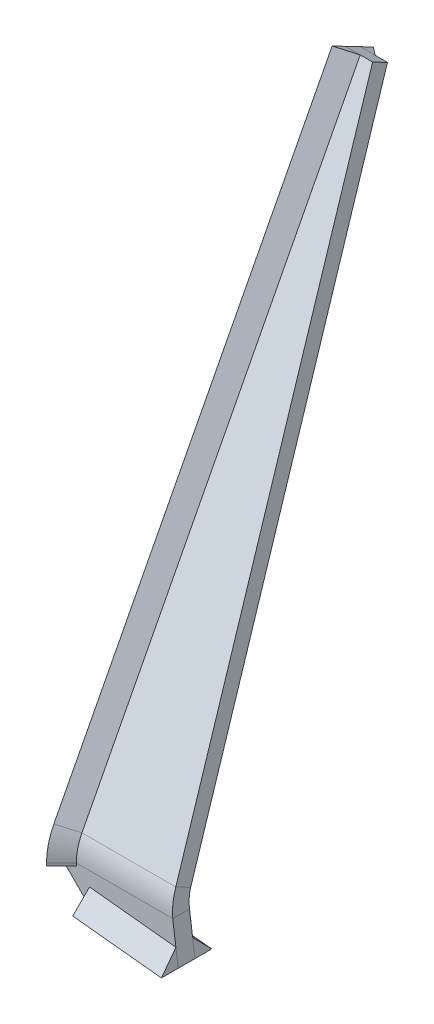
ISO-10303-21;
HEADER;
FILE_DESCRIPTION(('STEP AP214'),'2;1');
FILE_NAME('part.step','',(''),(''),'','','');
FILE_SCHEMA(('AUTOMOTIVE_DESIGN { 1 0 10303 214 1 1 1 1 }'));
ENDSEC;
DATA;
#1=APPLICATION_CONTEXT('core data for automotive mechanical design processes');
#2=APPLICATION_PROTOCOL_DEFINITION('international standard','automotive_design',2000,#1);
#3=PRODUCT_CONTEXT('',#1,'mechanical');
#4=PRODUCT('Part','Part','',(#3));
#5=PRODUCT_RELATED_PRODUCT_CATEGORY('part','',(#4));
#6=PRODUCT_DEFINITION_FORMATION('','',#4);
#7=PRODUCT_DEFINITION_CONTEXT('part definition',#1,'design');
#8=PRODUCT_DEFINITION('design','',#6,#7);
#9=PRODUCT_DEFINITION_SHAPE('','',#8);
#10=(LENGTH_UNIT() NAMED_UNIT(*) SI_UNIT(.MILLI.,.METRE.));
#11=(NAMED_UNIT(*) PLANE_ANGLE_UNIT() SI_UNIT($,.RADIAN.));
#12=(NAMED_UNIT(*) SI_UNIT($,.STERADIAN.) SOLID_ANGLE_UNIT());
#13=UNCERTAINTY_MEASURE_WITH_UNIT(LENGTH_MEASURE(1.E-05),#10,'distance_accuracy_value','');
#14=(GEOMETRIC_REPRESENTATION_CONTEXT(3) GLOBAL_UNCERTAINTY_ASSIGNED_CONTEXT((#13)) GLOBAL_UNIT_ASSIGNED_CONTEXT((#10,
#11,#12)) REPRESENTATION_CONTEXT('',''));
#15=CARTESIAN_POINT('',(0.,0.,0.));
#16=DIRECTION('',(0.,0.,1.));
#17=DIRECTION('',(1.,0.,0.));
#18=AXIS2_PLACEMENT_3D('',#15,#16,#17);
#19=CARTESIAN_POINT('',(3.54804333271288,6.67696676559556,4.00000000000001));
#20=DIRECTION('',(0.,0.,1.));
#21=DIRECTION('',(1.,0.,0.));
#22=AXIS2_PLACEMENT_3D('',#19,#20,#21);
#23=PLANE('',#22);
#24=DIRECTION('',(-1.,0.,0.));
#25=VECTOR('',#24,1.);
#26=CARTESIAN_POINT('',(3.54804333271288,6.67696676559556,4.00000000000001));
#27=LINE('',#26,#25);
#28=CARTESIAN_POINT('',(3.54804333271288,6.67696676559556,4.00000000000001));
#29=VERTEX_POINT('',#28);
#30=CARTESIAN_POINT('',(0.,6.67696676559556,4.00000000000001));
#31=VERTEX_POINT('',#30);
#32=EDGE_CURVE('E123',#29,#31,#27,.T.);
#33=ORIENTED_EDGE('',*,*,#32,.F.);
#34=DIRECTION('',(0.,-1.,0.));
#35=VECTOR('',#34,1.);
#36=CARTESIAN_POINT('',(3.54804333271288,6.67696676559556,4.00000000000001));
#37=LINE('',#36,#35);
#38=CARTESIAN_POINT('',(3.54804333271288,6.00000000000009,4.00000000000001));
#39=VERTEX_POINT('',#38);
#40=EDGE_CURVE('E66',#29,#39,#37,.T.);
#41=ORIENTED_EDGE('',*,*,#40,.T.);
#42=DIRECTION('',(-1.,0.,0.));
#43=VECTOR('',#42,1.);
#44=CARTESIAN_POINT('',(3.54804333271288,6.00000000000009,4.00000000000001));
#45=LINE('',#44,#43);
#46=CARTESIAN_POINT('',(0.,6.00000000000009,4.00000000000001));
#47=VERTEX_POINT('',#46);
#48=EDGE_CURVE('E73',#39,#47,#45,.T.);
#49=ORIENTED_EDGE('',*,*,#48,.T.);
#50=DIRECTION('',(0.,-1.,0.));
#51=VECTOR('',#50,1.);
#52=CARTESIAN_POINT('',(0.,6.67696676559556,4.00000000000001));
#53=LINE('',#52,#51);
#54=EDGE_CURVE('E13',#31,#47,#53,.T.);
#55=ORIENTED_EDGE('',*,*,#54,.F.);
#56=EDGE_LOOP('',(#33,#41,#49,#55));
#57=FACE_BOUND('',#56,.T.);
#58=ADVANCED_FACE('F59',(#57),#23,.F.);
#59=CARTESIAN_POINT('',(0.,6.67696676559555,7.5480433327129));
#60=DIRECTION('',(-0.707106781186548,0.,-0.707106781186547));
#61=DIRECTION('',(-0.707106781186547,0.,0.707106781186548));
#62=AXIS2_PLACEMENT_3D('',#59,#60,#61);
#63=PLANE('',#62);
#64=DIRECTION('',(0.707106781186547,0.,-0.707106781186548));
#65=VECTOR('',#64,1.);
#66=CARTESIAN_POINT('',(0.,6.67696676559555,7.5480433327129));
#67=LINE('',#66,#65);
#68=CARTESIAN_POINT('',(0.,6.67696676559555,7.5480433327129));
#69=VERTEX_POINT('',#68);
#70=EDGE_CURVE('E146',#69,#29,#67,.T.);
#71=ORIENTED_EDGE('',*,*,#70,.F.);
#72=DIRECTION('',(0.,-1.,0.));
#73=VECTOR('',#72,1.);
#74=CARTESIAN_POINT('',(0.,6.67696676559555,7.5480433327129));
#75=LINE('',#74,#73);
#76=CARTESIAN_POINT('',(0.,6.00000000000008,7.5480433327129));
#77=VERTEX_POINT('',#76);
#78=EDGE_CURVE('E118',#69,#77,#75,.T.);
#79=ORIENTED_EDGE('',*,*,#78,.T.);
#80=DIRECTION('',(0.707106781186547,0.,-0.707106781186548));
#81=VECTOR('',#80,1.);
#82=CARTESIAN_POINT('',(0.,6.00000000000008,7.5480433327129));
#83=LINE('',#82,#81);
#84=EDGE_CURVE('E81',#77,#39,#83,.T.);
#85=ORIENTED_EDGE('',*,*,#84,.T.);
#86=ORIENTED_EDGE('',*,*,#40,.F.);
#87=EDGE_LOOP('',(#71,#79,#85,#86));
#88=FACE_BOUND('',#87,.T.);
#89=ADVANCED_FACE('F159',(#88),#63,.F.);
#90=CARTESIAN_POINT('',(0.,6.67696676559554,-8.));
#91=DIRECTION('',(1.,0.,0.));
#92=DIRECTION('',(0.,1.,0.));
#93=AXIS2_PLACEMENT_3D('',#90,#91,#92);
#94=CYLINDRICAL_SURFACE('',#93,12.);
#95=DIRECTION('',(-1.,0.,0.));
#96=VECTOR('',#95,1.);
#97=CARTESIAN_POINT('',(3.54804333271288,12.217950124416,2.64412999813864));
#98=LINE('',#97,#96);
#99=CARTESIAN_POINT('',(3.54804333271288,12.217950124416,2.64412999813864));
#100=VERTEX_POINT('',#99);
#101=CARTESIAN_POINT('',(0.,12.217950124416,2.64412999813864));
#102=VERTEX_POINT('',#101);
#103=EDGE_CURVE('E131',#100,#102,#98,.T.);
#104=ORIENTED_EDGE('',*,*,#103,.F.);
#105=CARTESIAN_POINT('',(3.54804333271288,6.67696676559554,-8.));
#106=DIRECTION('',(1.,0.,0.));
#107=DIRECTION('',(0.,1.,0.));
#108=AXIS2_PLACEMENT_3D('',#105,#106,#107);
#109=CIRCLE('',#108,12.);
#110=EDGE_CURVE('E122',#100,#29,#109,.T.);
#111=ORIENTED_EDGE('',*,*,#110,.T.);
#112=ORIENTED_EDGE('',*,*,#32,.T.);
#113=CARTESIAN_POINT('',(0.,6.67696676559554,-8.));
#114=DIRECTION('',(1.,0.,0.));
#115=DIRECTION('',(0.,1.,0.));
#116=AXIS2_PLACEMENT_3D('',#113,#114,#115);
#117=CIRCLE('',#116,12.);
#118=EDGE_CURVE('E151',#102,#31,#117,.T.);
#119=ORIENTED_EDGE('',*,*,#118,.F.);
#120=EDGE_LOOP('',(#104,#111,#112,#119));
#121=FACE_BOUND('',#120,.T.);
#122=ADVANCED_FACE('F161',(#121),#94,.F.);
#123=CARTESIAN_POINT('',(0.,6.67696676559554,-8.));
#124=DIRECTION('',(-1.,0.,0.));
#125=DIRECTION('',(0.,-1.,0.));
#126=AXIS2_PLACEMENT_3D('',#123,#124,#125);
#127=CONICAL_SURFACE('',#126,15.5480433327129,0.785398163397448);
#128=DIRECTION('',(0.707106781186547,-0.326505575621977,-0.62721137512625));
#129=VECTOR('',#128,1.);
#130=CARTESIAN_POINT('',(0.,13.856254212994,5.79128287084073));
#131=LINE('',#130,#129);
#132=CARTESIAN_POINT('',(0.,13.856254212994,5.79128287084073));
#133=VERTEX_POINT('',#132);
#134=EDGE_CURVE('E126',#133,#100,#131,.T.);
#135=ORIENTED_EDGE('',*,*,#134,.F.);
#136=CARTESIAN_POINT('',(0.,6.67696676559554,-8.));
#137=DIRECTION('',(1.,0.,0.));
#138=DIRECTION('',(0.,1.,0.));
#139=AXIS2_PLACEMENT_3D('',#136,#137,#138);
#140=CIRCLE('',#139,15.5480433327129);
#141=EDGE_CURVE('E111',#133,#69,#140,.T.);
#142=ORIENTED_EDGE('',*,*,#141,.T.);
#143=ORIENTED_EDGE('',*,*,#70,.T.);
#144=ORIENTED_EDGE('',*,*,#110,.F.);
#145=EDGE_LOOP('',(#135,#142,#143,#144));
#146=FACE_BOUND('',#145,.T.);
#147=ADVANCED_FACE('F127',(#146),#127,.T.);
#148=CARTESIAN_POINT('',(0.,12.217950124416,2.64412999813864));
#149=DIRECTION('',(-1.,0.,0.));
#150=DIRECTION('',(0.,0.,1.));
#151=AXIS2_PLACEMENT_3D('',#148,#149,#150);
#152=PLANE('',#151);
#153=DIRECTION('',(0.,0.461748613235034,0.887010833178221));
#154=VECTOR('',#153,1.);
#155=CARTESIAN_POINT('',(0.,139.660976123687,-63.6985101596913));
#156=LINE('',#155,#154);
#157=CARTESIAN_POINT('',(0.,139.660976123687,-63.6985101596913));
#158=VERTEX_POINT('',#157);
#159=CARTESIAN_POINT('',(0.,141.299280212264,-60.5513572869892));
#160=VERTEX_POINT('',#159);
#161=EDGE_CURVE('E170',#158,#160,#156,.T.);
#162=ORIENTED_EDGE('',*,*,#161,.F.);
#163=DIRECTION('',(0.,0.887010833178221,-0.461748613235035));
#164=VECTOR('',#163,1.);
#165=CARTESIAN_POINT('',(0.,12.217950124416,2.64412999813864));
#166=LINE('',#165,#164);
#167=EDGE_CURVE('E140',#102,#158,#166,.T.);
#168=ORIENTED_EDGE('',*,*,#167,.F.);
#169=ORIENTED_EDGE('',*,*,#118,.T.);
#170=ORIENTED_EDGE('',*,*,#54,.T.);
#171=DIRECTION('',(0.,0.,1.));
#172=VECTOR('',#171,1.);
#173=CARTESIAN_POINT('',(0.,6.00000000000009,4.00000000000001));
#174=LINE('',#173,#172);
#175=EDGE_CURVE('E154',#47,#77,#174,.T.);
#176=ORIENTED_EDGE('',*,*,#175,.T.);
#177=ORIENTED_EDGE('',*,*,#78,.F.);
#178=ORIENTED_EDGE('',*,*,#141,.F.);
#179=DIRECTION('',(0.,0.887010833178221,-0.461748613235035));
#180=VECTOR('',#179,1.);
#181=CARTESIAN_POINT('',(0.,13.856254212994,5.79128287084073));
#182=LINE('',#181,#180);
#183=EDGE_CURVE('E116',#133,#160,#182,.T.);
#184=ORIENTED_EDGE('',*,*,#183,.T.);
#185=EDGE_LOOP('',(#162,#168,#169,#170,#176,#177,#178,#184));
#186=FACE_BOUND('',#185,.T.);
#187=ADVANCED_FACE('F114',(#186),#152,.T.);
#188=CARTESIAN_POINT('',(3.54804333271288,12.217950124416,2.64412999813864));
#189=DIRECTION('',(0.,-0.461748613235035,-0.887010833178221));
#190=DIRECTION('',(0.,0.887010833178221,-0.461748613235035));
#191=AXIS2_PLACEMENT_3D('',#188,#189,#190);
#192=PLANE('',#191);
#193=DIRECTION('',(-1.,0.,0.));
#194=VECTOR('',#193,1.);
#195=CARTESIAN_POINT('',(3.54804333271288,139.660976123687,-63.6985101596913));
#196=LINE('',#195,#194);
#197=CARTESIAN_POINT('',(3.54804333271288,139.660976123687,-63.6985101596913));
#198=VERTEX_POINT('',#197);
#199=EDGE_CURVE('E132',#198,#158,#196,.T.);
#200=ORIENTED_EDGE('',*,*,#199,.F.);
#201=DIRECTION('',(0.,0.887010833178221,-0.461748613235035));
#202=VECTOR('',#201,1.);
#203=CARTESIAN_POINT('',(3.54804333271288,12.217950124416,2.64412999813864));
#204=LINE('',#203,#202);
#205=EDGE_CURVE('E138',#100,#198,#204,.T.);
#206=ORIENTED_EDGE('',*,*,#205,.F.);
#207=ORIENTED_EDGE('',*,*,#103,.T.);
#208=ORIENTED_EDGE('',*,*,#167,.T.);
#209=EDGE_LOOP('',(#200,#206,#207,#208));
#210=FACE_BOUND('',#209,.T.);
#211=ADVANCED_FACE('F166',(#210),#192,.T.);
#212=CARTESIAN_POINT('',(0.,13.856254212994,5.79128287084073));
#213=DIRECTION('',(0.707106781186548,0.326505575621977,0.627211375126249));
#214=DIRECTION('',(0.663578618400424,0.,-0.748106554711148));
#215=AXIS2_PLACEMENT_3D('',#212,#213,#214);
#216=PLANE('',#215);
#217=DIRECTION('',(0.707106781186547,-0.326505575621977,-0.62721137512625));
#218=VECTOR('',#217,1.);
#219=CARTESIAN_POINT('',(0.,141.299280212264,-60.5513572869892));
#220=LINE('',#219,#218);
#221=EDGE_CURVE('E136',#160,#198,#220,.T.);
#222=ORIENTED_EDGE('',*,*,#221,.F.);
#223=ORIENTED_EDGE('',*,*,#183,.F.);
#224=ORIENTED_EDGE('',*,*,#134,.T.);
#225=ORIENTED_EDGE('',*,*,#205,.T.);
#226=EDGE_LOOP('',(#222,#223,#224,#225));
#227=FACE_BOUND('',#226,.T.);
#228=ADVANCED_FACE('F134',(#227),#216,.T.);
#229=CARTESIAN_POINT('',(0.,6.00000000000009,4.00000000000001));
#230=DIRECTION('',(0.,-1.,0.));
#231=DIRECTION('',(0.,0.,-1.));
#232=AXIS2_PLACEMENT_3D('',#229,#230,#231);
#233=PLANE('',#232);
#234=ORIENTED_EDGE('',*,*,#175,.F.);
#235=ORIENTED_EDGE('',*,*,#48,.F.);
#236=ORIENTED_EDGE('',*,*,#84,.F.);
#237=EDGE_LOOP('',(#234,#235,#236));
#238=FACE_BOUND('',#237,.T.);
#239=ADVANCED_FACE('F175',(#238),#233,.T.);
#240=CARTESIAN_POINT('',(0.,139.660976123687,-63.6985101596913));
#241=DIRECTION('',(0.,-0.887010833178221,0.461748613235034));
#242=DIRECTION('',(0.,-0.461748613235034,-0.887010833178221));
#243=AXIS2_PLACEMENT_3D('',#240,#241,#242);
#244=PLANE('',#243);
#245=ORIENTED_EDGE('',*,*,#161,.T.);
#246=ORIENTED_EDGE('',*,*,#221,.T.);
#247=ORIENTED_EDGE('',*,*,#199,.T.);
#248=EDGE_LOOP('',(#245,#246,#247));
#249=FACE_BOUND('',#248,.T.);
#250=ADVANCED_FACE('F169',(#249),#244,.F.);
#251=CLOSED_SHELL('',(#58,#89,#122,#147,#187,#211,#228,#239,#250));
#252=MANIFOLD_SOLID_BREP('B2',#251);
#253=CARTESIAN_POINT('',(3.54804333271288,6.67696676559557,0.));
#254=DIRECTION('',(0.,0.,-1.));
#255=DIRECTION('',(-1.,0.,0.));
#256=AXIS2_PLACEMENT_3D('',#253,#254,#255);
#257=PLANE('',#256);
#258=DIRECTION('',(1.,0.,0.));
#259=VECTOR('',#258,1.);
#260=CARTESIAN_POINT('',(3.54804333271288,6.67696676559557,0.));
#261=LINE('',#260,#259);
#262=CARTESIAN_POINT('',(0.,6.67696676559557,0.));
#263=VERTEX_POINT('',#262);
#264=CARTESIAN_POINT('',(3.54804333271288,6.67696676559557,0.));
#265=VERTEX_POINT('',#264);
#266=EDGE_CURVE('E328',#263,#265,#261,.T.);
#267=ORIENTED_EDGE('',*,*,#266,.F.);
#268=DIRECTION('',(0.,-1.,0.));
#269=VECTOR('',#268,1.);
#270=CARTESIAN_POINT('',(0.,6.67696676559557,0.));
#271=LINE('',#270,#269);
#272=CARTESIAN_POINT('',(0.,6.0000000000001,0.));
#273=VERTEX_POINT('',#272);
#274=EDGE_CURVE('E271',#263,#273,#271,.T.);
#275=ORIENTED_EDGE('',*,*,#274,.T.);
#276=DIRECTION('',(1.,0.,0.));
#277=VECTOR('',#276,1.);
#278=CARTESIAN_POINT('',(3.54804333271288,6.0000000000001,0.));
#279=LINE('',#278,#277);
#280=CARTESIAN_POINT('',(3.54804333271288,6.0000000000001,0.));
#281=VERTEX_POINT('',#280);
#282=EDGE_CURVE('E278',#273,#281,#279,.T.);
#283=ORIENTED_EDGE('',*,*,#282,.T.);
#284=DIRECTION('',(0.,-1.,0.));
#285=VECTOR('',#284,1.);
#286=CARTESIAN_POINT('',(3.54804333271288,6.67696676559557,0.));
#287=LINE('',#286,#285);
#288=EDGE_CURVE('E57',#265,#281,#287,.T.);
#289=ORIENTED_EDGE('',*,*,#288,.F.);
#290=EDGE_LOOP('',(#267,#275,#283,#289));
#291=FACE_BOUND('',#290,.T.);
#292=ADVANCED_FACE('F264',(#291),#257,.F.);
#293=CARTESIAN_POINT('',(0.,6.67696676559558,-3.5480433327129));
#294=DIRECTION('',(-0.707106781186548,0.,0.707106781186547));
#295=DIRECTION('',(0.707106781186547,0.,0.707106781186548));
#296=AXIS2_PLACEMENT_3D('',#293,#294,#295);
#297=PLANE('',#296);
#298=DIRECTION('',(-0.707106781186547,0.,-0.707106781186548));
#299=VECTOR('',#298,1.);
#300=CARTESIAN_POINT('',(0.,6.67696676559558,-3.5480433327129));
#301=LINE('',#300,#299);
#302=CARTESIAN_POINT('',(0.,6.67696676559558,-3.5480433327129));
#303=VERTEX_POINT('',#302);
#304=EDGE_CURVE('E326',#265,#303,#301,.T.);
#305=ORIENTED_EDGE('',*,*,#304,.F.);
#306=ORIENTED_EDGE('',*,*,#288,.T.);
#307=DIRECTION('',(-0.707106781186547,0.,-0.707106781186548));
#308=VECTOR('',#307,1.);
#309=CARTESIAN_POINT('',(0.,6.00000000000011,-3.5480433327129));
#310=LINE('',#309,#308);
#311=CARTESIAN_POINT('',(0.,6.00000000000011,-3.5480433327129));
#312=VERTEX_POINT('',#311);
#313=EDGE_CURVE('E362',#281,#312,#310,.T.);
#314=ORIENTED_EDGE('',*,*,#313,.T.);
#315=DIRECTION('',(0.,-1.,0.));
#316=VECTOR('',#315,1.);
#317=CARTESIAN_POINT('',(0.,6.67696676559558,-3.5480433327129));
#318=LINE('',#317,#316);
#319=EDGE_CURVE('E366',#303,#312,#318,.T.);
#320=ORIENTED_EDGE('',*,*,#319,.F.);
#321=EDGE_LOOP('',(#305,#306,#314,#320));
#322=FACE_BOUND('',#321,.T.);
#323=ADVANCED_FACE('F387',(#322),#297,.F.);
#324=CARTESIAN_POINT('',(0.,6.67696676559554,-8.));
#325=DIRECTION('',(1.,0.,0.));
#326=DIRECTION('',(0.,1.,0.));
#327=AXIS2_PLACEMENT_3D('',#324,#325,#326);
#328=CYLINDRICAL_SURFACE('',#327,7.99999999999999);
#329=DIRECTION('',(1.,0.,0.));
#330=VECTOR('',#329,1.);
#331=CARTESIAN_POINT('',(3.54804333271288,10.3709556714759,-0.903913334574263));
#332=LINE('',#331,#330);
#333=CARTESIAN_POINT('',(0.,10.3709556714759,-0.903913334574263));
#334=VERTEX_POINT('',#333);
#335=CARTESIAN_POINT('',(3.54804333271288,10.3709556714759,-0.903913334574263));
#336=VERTEX_POINT('',#335);
#337=EDGE_CURVE('E339',#334,#336,#332,.T.);
#338=ORIENTED_EDGE('',*,*,#337,.F.);
#339=CARTESIAN_POINT('',(0.,6.67696676559554,-8.));
#340=DIRECTION('',(1.,0.,0.));
#341=DIRECTION('',(0.,1.,0.));
#342=AXIS2_PLACEMENT_3D('',#339,#340,#341);
#343=CIRCLE('',#342,7.99999999999999);
#344=EDGE_CURVE('E327',#334,#263,#343,.T.);
#345=ORIENTED_EDGE('',*,*,#344,.T.);
#346=ORIENTED_EDGE('',*,*,#266,.T.);
#347=CARTESIAN_POINT('',(3.54804333271288,6.67696676559554,-8.));
#348=DIRECTION('',(1.,0.,0.));
#349=DIRECTION('',(0.,1.,0.));
#350=AXIS2_PLACEMENT_3D('',#347,#348,#349);
#351=CIRCLE('',#350,7.99999999999999);
#352=EDGE_CURVE('E360',#336,#265,#351,.T.);
#353=ORIENTED_EDGE('',*,*,#352,.F.);
#354=EDGE_LOOP('',(#338,#345,#346,#353));
#355=FACE_BOUND('',#354,.T.);
#356=ADVANCED_FACE('F371',(#355),#328,.T.);
#357=CARTESIAN_POINT('',(3.54804333271288,6.67696676559554,-8.));
#358=DIRECTION('',(1.,0.,0.));
#359=DIRECTION('',(0.,1.,0.));
#360=AXIS2_PLACEMENT_3D('',#357,#358,#359);
#361=CONICAL_SURFACE('',#360,7.99999999999999,0.785398163397449);
#362=DIRECTION('',(-0.707106781186547,-0.326505575621977,-0.62721137512625));
#363=VECTOR('',#362,1.);
#364=CARTESIAN_POINT('',(0.,8.73265158289788,-4.05106620727635));
#365=LINE('',#364,#363);
#366=CARTESIAN_POINT('',(0.,8.73265158289788,-4.05106620727635));
#367=VERTEX_POINT('',#366);
#368=EDGE_CURVE('E323',#336,#367,#365,.T.);
#369=ORIENTED_EDGE('',*,*,#368,.F.);
#370=ORIENTED_EDGE('',*,*,#352,.T.);
#371=ORIENTED_EDGE('',*,*,#304,.T.);
#372=CARTESIAN_POINT('',(0.,6.67696676559554,-8.));
#373=DIRECTION('',(1.,0.,0.));
#374=DIRECTION('',(0.,1.,0.));
#375=AXIS2_PLACEMENT_3D('',#372,#373,#374);
#376=CIRCLE('',#375,4.4519566672871);
#377=EDGE_CURVE('E318',#367,#303,#376,.T.);
#378=ORIENTED_EDGE('',*,*,#377,.F.);
#379=EDGE_LOOP('',(#369,#370,#371,#378));
#380=FACE_BOUND('',#379,.T.);
#381=ADVANCED_FACE('F320',(#380),#361,.F.);
#382=CARTESIAN_POINT('',(0.,8.73265158289788,-4.05106620727635));
#383=DIRECTION('',(0.707106781186548,-0.326505575621977,-0.627211375126249));
#384=DIRECTION('',(-0.663578618400424,0.,-0.748106554711148));
#385=AXIS2_PLACEMENT_3D('',#382,#383,#384);
#386=PLANE('',#385);
#387=DIRECTION('',(-0.707106781186547,-0.326505575621977,-0.62721137512625));
#388=VECTOR('',#387,1.);
#389=CARTESIAN_POINT('',(0.,136.175677582168,-70.3937063651063));
#390=LINE('',#389,#388);
#391=CARTESIAN_POINT('',(3.54804333271288,137.813981670746,-67.2465534924042));
#392=VERTEX_POINT('',#391);
#393=CARTESIAN_POINT('',(0.,136.175677582168,-70.3937063651063));
#394=VERTEX_POINT('',#393);
#395=EDGE_CURVE('E350',#392,#394,#390,.T.);
#396=ORIENTED_EDGE('',*,*,#395,.F.);
#397=DIRECTION('',(0.,0.887010833178221,-0.461748613235035));
#398=VECTOR('',#397,1.);
#399=CARTESIAN_POINT('',(3.54804333271288,10.3709556714759,-0.903913334574263));
#400=LINE('',#399,#398);
#401=EDGE_CURVE('E342',#336,#392,#400,.T.);
#402=ORIENTED_EDGE('',*,*,#401,.F.);
#403=ORIENTED_EDGE('',*,*,#368,.T.);
#404=DIRECTION('',(0.,0.887010833178221,-0.461748613235035));
#405=VECTOR('',#404,1.);
#406=CARTESIAN_POINT('',(0.,8.73265158289788,-4.05106620727635));
#407=LINE('',#406,#405);
#408=EDGE_CURVE('E331',#367,#394,#407,.T.);
#409=ORIENTED_EDGE('',*,*,#408,.T.);
#410=EDGE_LOOP('',(#396,#402,#403,#409));
#411=FACE_BOUND('',#410,.T.);
#412=ADVANCED_FACE('F341',(#411),#386,.T.);
#413=CARTESIAN_POINT('',(3.54804333271288,10.3709556714759,-0.903913334574263));
#414=DIRECTION('',(0.,0.461748613235035,0.887010833178221));
#415=DIRECTION('',(0.,-0.887010833178221,0.461748613235035));
#416=AXIS2_PLACEMENT_3D('',#413,#414,#415);
#417=PLANE('',#416);
#418=DIRECTION('',(1.,0.,0.));
#419=VECTOR('',#418,1.);
#420=CARTESIAN_POINT('',(3.54804333271288,137.813981670746,-67.2465534924042));
#421=LINE('',#420,#419);
#422=CARTESIAN_POINT('',(0.,137.813981670746,-67.2465534924042));
#423=VERTEX_POINT('',#422);
#424=EDGE_CURVE('E344',#423,#392,#421,.T.);
#425=ORIENTED_EDGE('',*,*,#424,.F.);
#426=DIRECTION('',(0.,0.887010833178221,-0.461748613235035));
#427=VECTOR('',#426,1.);
#428=CARTESIAN_POINT('',(0.,10.3709556714759,-0.903913334574263));
#429=LINE('',#428,#427);
#430=EDGE_CURVE('E338',#334,#423,#429,.T.);
#431=ORIENTED_EDGE('',*,*,#430,.F.);
#432=ORIENTED_EDGE('',*,*,#337,.T.);
#433=ORIENTED_EDGE('',*,*,#401,.T.);
#434=EDGE_LOOP('',(#425,#431,#432,#433));
#435=FACE_BOUND('',#434,.T.);
#436=ADVANCED_FACE('F374',(#435),#417,.T.);
#437=CARTESIAN_POINT('',(0.,10.3709556714759,-0.903913334574263));
#438=DIRECTION('',(-1.,0.,0.));
#439=DIRECTION('',(0.,-1.,0.));
#440=AXIS2_PLACEMENT_3D('',#437,#438,#439);
#441=PLANE('',#440);
#442=DIRECTION('',(0.,0.461748613235034,0.887010833178221));
#443=VECTOR('',#442,1.);
#444=CARTESIAN_POINT('',(0.,137.813981670746,-67.2465534924042));
#445=LINE('',#444,#443);
#446=EDGE_CURVE('E334',#394,#423,#445,.T.);
#447=ORIENTED_EDGE('',*,*,#446,.F.);
#448=ORIENTED_EDGE('',*,*,#408,.F.);
#449=ORIENTED_EDGE('',*,*,#377,.T.);
#450=ORIENTED_EDGE('',*,*,#319,.T.);
#451=DIRECTION('',(0.,0.,1.));
#452=VECTOR('',#451,1.);
#453=CARTESIAN_POINT('',(0.,6.0000000000001,0.));
#454=LINE('',#453,#452);
#455=EDGE_CURVE('E286',#312,#273,#454,.T.);
#456=ORIENTED_EDGE('',*,*,#455,.T.);
#457=ORIENTED_EDGE('',*,*,#274,.F.);
#458=ORIENTED_EDGE('',*,*,#344,.F.);
#459=ORIENTED_EDGE('',*,*,#430,.T.);
#460=EDGE_LOOP('',(#447,#448,#449,#450,#456,#457,#458,#459));
#461=FACE_BOUND('',#460,.T.);
#462=ADVANCED_FACE('F332',(#461),#441,.T.);
#463=CARTESIAN_POINT('',(3.54804333271288,6.0000000000001,0.));
#464=DIRECTION('',(0.,-1.,0.));
#465=DIRECTION('',(0.,0.,-1.));
#466=AXIS2_PLACEMENT_3D('',#463,#464,#465);
#467=PLANE('',#466);
#468=ORIENTED_EDGE('',*,*,#313,.F.);
#469=ORIENTED_EDGE('',*,*,#282,.F.);
#470=ORIENTED_EDGE('',*,*,#455,.F.);
#471=EDGE_LOOP('',(#468,#469,#470));
#472=FACE_BOUND('',#471,.T.);
#473=ADVANCED_FACE('F378',(#472),#467,.T.);
#474=CARTESIAN_POINT('',(3.54804333271288,137.813981670746,-67.2465534924042));
#475=DIRECTION('',(0.,-0.887010833178221,0.461748613235034));
#476=DIRECTION('',(0.,-0.461748613235034,-0.887010833178221));
#477=AXIS2_PLACEMENT_3D('',#474,#475,#476);
#478=PLANE('',#477);
#479=ORIENTED_EDGE('',*,*,#395,.T.);
#480=ORIENTED_EDGE('',*,*,#446,.T.);
#481=ORIENTED_EDGE('',*,*,#424,.T.);
#482=EDGE_LOOP('',(#479,#480,#481));
#483=FACE_BOUND('',#482,.T.);
#484=ADVANCED_FACE('F376',(#483),#478,.F.);
#485=CLOSED_SHELL('',(#292,#323,#356,#381,#412,#436,#462,#473,#484));
#486=MANIFOLD_SOLID_BREP('B7',#485);
#487=CARTESIAN_POINT('',(6.70469146960512,-0.704691469605121,4.));
#488=DIRECTION('',(-1.,0.,0.));
#489=DIRECTION('',(0.,0.,1.));
#490=AXIS2_PLACEMENT_3D('',#487,#488,#489);
#491=PLANE('',#490);
#492=DIRECTION('',(0.,1.,0.));
#493=VECTOR('',#492,1.);
#494=CARTESIAN_POINT('',(6.70469146960512,3.29530853039488,4.));
#495=LINE('',#494,#493);
#496=CARTESIAN_POINT('',(6.70469146960512,-0.704691469605121,4.));
#497=VERTEX_POINT('',#496);
#498=CARTESIAN_POINT('',(6.70469146960512,3.29530853039488,4.));
#499=VERTEX_POINT('',#498);
#500=EDGE_CURVE('E511',#497,#499,#495,.T.);
#501=ORIENTED_EDGE('',*,*,#500,.F.);
#502=DIRECTION('',(0.,0.,-1.));
#503=VECTOR('',#502,1.);
#504=CARTESIAN_POINT('',(6.70469146960512,-0.704691469605121,4.));
#505=LINE('',#504,#503);
#506=CARTESIAN_POINT('',(6.70469146960512,-0.704691469605122,8.));
#507=VERTEX_POINT('',#506);
#508=EDGE_CURVE('E513',#507,#497,#505,.T.);
#509=ORIENTED_EDGE('',*,*,#508,.F.);
#510=DIRECTION('',(0.,-0.707106781186548,0.707106781186547));
#511=VECTOR('',#510,1.);
#512=CARTESIAN_POINT('',(6.70469146960512,3.29530853039488,4.));
#513=LINE('',#512,#511);
#514=EDGE_CURVE('E504',#499,#507,#513,.T.);
#515=ORIENTED_EDGE('',*,*,#514,.F.);
#516=EDGE_LOOP('',(#501,#509,#515));
#517=FACE_BOUND('',#516,.T.);
#518=ADVANCED_FACE('F469',(#517),#491,.T.);
#519=CARTESIAN_POINT('',(33.2805950239565,-3.49793148917952,4.));
#520=DIRECTION('',(0.104528463267651,0.994521895368274,0.));
#521=DIRECTION('',(-0.994521895368274,0.104528463267651,0.));
#522=AXIS2_PLACEMENT_3D('',#519,#520,#521);
#523=PLANE('',#522);
#524=DIRECTION('',(-0.994521895368274,0.104528463267651,0.));
#525=VECTOR('',#524,1.);
#526=CARTESIAN_POINT('',(33.2805950239565,-3.49793148917952,4.));
#527=LINE('',#526,#525);
#528=CARTESIAN_POINT('',(27.8466130703117,-2.92679697149421,4.));
#529=VERTEX_POINT('',#528);
#530=EDGE_CURVE('E516',#529,#497,#527,.T.);
#531=ORIENTED_EDGE('',*,*,#530,.F.);
#532=DIRECTION('',(0.,0.,1.));
#533=VECTOR('',#532,1.);
#534=CARTESIAN_POINT('',(27.8466130703117,-2.92679697149421,4.));
#535=LINE('',#534,#533);
#536=CARTESIAN_POINT('',(27.8466130703117,-2.92679697149421,8.));
#537=VERTEX_POINT('',#536);
#538=EDGE_CURVE('E473',#529,#537,#535,.T.);
#539=ORIENTED_EDGE('',*,*,#538,.T.);
#540=DIRECTION('',(-0.994521895368274,0.104528463267651,0.));
#541=VECTOR('',#540,1.);
#542=CARTESIAN_POINT('',(33.2805950239565,-3.49793148917952,8.));
#543=LINE('',#542,#541);
#544=EDGE_CURVE('E508',#537,#507,#543,.T.);
#545=ORIENTED_EDGE('',*,*,#544,.T.);
#546=ORIENTED_EDGE('',*,*,#508,.T.);
#547=EDGE_LOOP('',(#531,#539,#545,#546));
#548=FACE_BOUND('',#547,.T.);
#549=ADVANCED_FACE('F524',(#548),#523,.F.);
#550=CARTESIAN_POINT('',(33.2805950239565,0.502068510820482,4.));
#551=DIRECTION('',(-0.0741155126847491,-0.70516199939428,-0.70516199939428));
#552=DIRECTION('',(0.,0.707106781186548,-0.707106781186547));
#553=AXIS2_PLACEMENT_3D('',#550,#551,#552);
#554=PLANE('',#553);
#555=ORIENTED_EDGE('',*,*,#544,.F.);
#556=DIRECTION('',(-0.0958164778483682,0.708870741875587,-0.698800024245483));
#557=VECTOR('',#556,1.);
#558=CARTESIAN_POINT('',(27.3957814505822,0.408551518817847,4.71203582231319));
#559=LINE('',#558,#557);
#560=CARTESIAN_POINT('',(27.2981501365742,1.13084880572784,4.));
#561=VERTEX_POINT('',#560);
#562=EDGE_CURVE('E479',#537,#561,#559,.T.);
#563=ORIENTED_EDGE('',*,*,#562,.T.);
#564=DIRECTION('',(-0.994521895368274,0.104528463267651,0.));
#565=VECTOR('',#564,1.);
#566=CARTESIAN_POINT('',(33.2805950239565,0.502068510820482,4.));
#567=LINE('',#566,#565);
#568=EDGE_CURVE('E500',#561,#499,#567,.T.);
#569=ORIENTED_EDGE('',*,*,#568,.T.);
#570=ORIENTED_EDGE('',*,*,#514,.T.);
#571=EDGE_LOOP('',(#555,#563,#569,#570));
#572=FACE_BOUND('',#571,.T.);
#573=ADVANCED_FACE('F503',(#572),#554,.F.);
#574=CARTESIAN_POINT('',(33.2805950239565,0.502068510820482,4.));
#575=DIRECTION('',(0.,0.,1.));
#576=DIRECTION('',(0.,-1.,0.));
#577=AXIS2_PLACEMENT_3D('',#574,#575,#576);
#578=PLANE('',#577);
#579=ORIENTED_EDGE('',*,*,#568,.F.);
#580=DIRECTION('',(0.133949657316128,-0.990988137822493,0.));
#581=VECTOR('',#580,1.);
#582=CARTESIAN_POINT('',(27.4889560997429,-0.280774410893808,4.));
#583=LINE('',#582,#581);
#584=EDGE_CURVE('E262',#561,#529,#583,.T.);
#585=ORIENTED_EDGE('',*,*,#584,.T.);
#586=ORIENTED_EDGE('',*,*,#530,.T.);
#587=ORIENTED_EDGE('',*,*,#500,.T.);
#588=EDGE_LOOP('',(#579,#585,#586,#587));
#589=FACE_BOUND('',#588,.T.);
#590=ADVANCED_FACE('F471',(#589),#578,.F.);
#591=CARTESIAN_POINT('',(27.8466130703117,-2.92679697149421,4.));
#592=DIRECTION('',(-0.990988137822493,-0.133949657316128,0.));
#593=DIRECTION('',(0.133949657316128,-0.990988137822493,0.));
#594=AXIS2_PLACEMENT_3D('',#591,#592,#593);
#595=PLANE('',#594);
#596=ORIENTED_EDGE('',*,*,#562,.F.);
#597=ORIENTED_EDGE('',*,*,#538,.F.);
#598=ORIENTED_EDGE('',*,*,#584,.F.);
#599=EDGE_LOOP('',(#596,#597,#598));
#600=FACE_BOUND('',#599,.T.);
#601=ADVANCED_FACE('F525',(#600),#595,.F.);
#602=CLOSED_SHELL('',(#518,#549,#573,#590,#601));
#603=MANIFOLD_SOLID_BREP('B51',#602);
#604=CARTESIAN_POINT('',(6.70469146960512,-0.70469146960512,-4.));
#605=DIRECTION('',(1.,0.,0.));
#606=DIRECTION('',(0.,0.,-1.));
#607=AXIS2_PLACEMENT_3D('',#604,#605,#606);
#608=PLANE('',#607);
#609=DIRECTION('',(0.,0.707106781186547,0.707106781186548));
#610=VECTOR('',#609,1.);
#611=CARTESIAN_POINT('',(6.70469146960512,3.29530853039488,0.));
#612=LINE('',#611,#610);
#613=CARTESIAN_POINT('',(6.70469146960512,-0.70469146960512,-4.));
#614=VERTEX_POINT('',#613);
#615=CARTESIAN_POINT('',(6.70469146960512,3.29530853039488,0.));
#616=VERTEX_POINT('',#615);
#617=EDGE_CURVE('E617',#614,#616,#612,.T.);
#618=ORIENTED_EDGE('',*,*,#617,.F.);
#619=DIRECTION('',(0.,0.,-1.));
#620=VECTOR('',#619,1.);
#621=CARTESIAN_POINT('',(6.70469146960512,-0.70469146960512,0.));
#622=LINE('',#621,#620);
#623=CARTESIAN_POINT('',(6.70469146960512,-0.70469146960512,0.));
#624=VERTEX_POINT('',#623);
#625=EDGE_CURVE('E619',#624,#614,#622,.T.);
#626=ORIENTED_EDGE('',*,*,#625,.F.);
#627=DIRECTION('',(0.,-1.,0.));
#628=VECTOR('',#627,1.);
#629=CARTESIAN_POINT('',(6.70469146960512,3.29530853039488,0.));
#630=LINE('',#629,#628);
#631=EDGE_CURVE('E610',#616,#624,#630,.T.);
#632=ORIENTED_EDGE('',*,*,#631,.F.);
#633=EDGE_LOOP('',(#618,#626,#632));
#634=FACE_BOUND('',#633,.T.);
#635=ADVANCED_FACE('F575',(#634),#608,.F.);
#636=CARTESIAN_POINT('',(33.2805950239565,-3.49793148917952,0.));
#637=DIRECTION('',(0.104528463267651,0.994521895368274,0.));
#638=DIRECTION('',(-0.994521895368274,0.104528463267651,0.));
#639=AXIS2_PLACEMENT_3D('',#636,#637,#638);
#640=PLANE('',#639);
#641=DIRECTION('',(-0.994521895368274,0.104528463267651,0.));
#642=VECTOR('',#641,1.);
#643=CARTESIAN_POINT('',(33.2805950239565,-3.49793148917952,-4.));
#644=LINE('',#643,#642);
#645=CARTESIAN_POINT('',(27.8466130703117,-2.92679697149421,-4.));
#646=VERTEX_POINT('',#645);
#647=EDGE_CURVE('E622',#646,#614,#644,.T.);
#648=ORIENTED_EDGE('',*,*,#647,.F.);
#649=DIRECTION('',(0.,0.,1.));
#650=VECTOR('',#649,1.);
#651=CARTESIAN_POINT('',(27.8466130703117,-2.92679697149421,0.));
#652=LINE('',#651,#650);
#653=CARTESIAN_POINT('',(27.8466130703117,-2.92679697149421,0.));
#654=VERTEX_POINT('',#653);
#655=EDGE_CURVE('E579',#646,#654,#652,.T.);
#656=ORIENTED_EDGE('',*,*,#655,.T.);
#657=DIRECTION('',(-0.994521895368274,0.104528463267651,0.));
#658=VECTOR('',#657,1.);
#659=CARTESIAN_POINT('',(33.2805950239565,-3.49793148917952,0.));
#660=LINE('',#659,#658);
#661=EDGE_CURVE('E614',#654,#624,#660,.T.);
#662=ORIENTED_EDGE('',*,*,#661,.T.);
#663=ORIENTED_EDGE('',*,*,#625,.T.);
#664=EDGE_LOOP('',(#648,#656,#662,#663));
#665=FACE_BOUND('',#664,.T.);
#666=ADVANCED_FACE('F630',(#665),#640,.F.);
#667=CARTESIAN_POINT('',(33.2805950239565,0.502068510820482,0.));
#668=DIRECTION('',(0.,0.,-1.));
#669=DIRECTION('',(0.,1.,0.));
#670=AXIS2_PLACEMENT_3D('',#667,#668,#669);
#671=PLANE('',#670);
#672=ORIENTED_EDGE('',*,*,#661,.F.);
#673=DIRECTION('',(-0.133949657316128,0.990988137822493,0.));
#674=VECTOR('',#673,1.);
#675=CARTESIAN_POINT('',(27.4889560997429,-0.280774410893807,0.));
#676=LINE('',#675,#674);
#677=CARTESIAN_POINT('',(27.2981501365742,1.13084880572784,0.));
#678=VERTEX_POINT('',#677);
#679=EDGE_CURVE('E585',#654,#678,#676,.T.);
#680=ORIENTED_EDGE('',*,*,#679,.T.);
#681=DIRECTION('',(-0.994521895368274,0.104528463267651,0.));
#682=VECTOR('',#681,1.);
#683=CARTESIAN_POINT('',(33.2805950239565,0.502068510820482,0.));
#684=LINE('',#683,#682);
#685=EDGE_CURVE('E606',#678,#616,#684,.T.);
#686=ORIENTED_EDGE('',*,*,#685,.T.);
#687=ORIENTED_EDGE('',*,*,#631,.T.);
#688=EDGE_LOOP('',(#672,#680,#686,#687));
#689=FACE_BOUND('',#688,.T.);
#690=ADVANCED_FACE('F609',(#689),#671,.F.);
#691=CARTESIAN_POINT('',(33.2805950239565,0.502068510820482,0.));
#692=DIRECTION('',(-0.0741155126847492,-0.70516199939428,0.70516199939428));
#693=DIRECTION('',(0.,-0.707106781186548,-0.707106781186548));
#694=AXIS2_PLACEMENT_3D('',#691,#692,#693);
#695=PLANE('',#694);
#696=ORIENTED_EDGE('',*,*,#685,.F.);
#697=DIRECTION('',(0.0958164778483682,-0.708870741875587,-0.698800024245484));
#698=VECTOR('',#697,1.);
#699=CARTESIAN_POINT('',(27.3957814505822,0.408551518817848,-0.712035822313193));
#700=LINE('',#699,#698);
#701=EDGE_CURVE('E467',#678,#646,#700,.T.);
#702=ORIENTED_EDGE('',*,*,#701,.T.);
#703=ORIENTED_EDGE('',*,*,#647,.T.);
#704=ORIENTED_EDGE('',*,*,#617,.T.);
#705=EDGE_LOOP('',(#696,#702,#703,#704));
#706=FACE_BOUND('',#705,.T.);
#707=ADVANCED_FACE('F577',(#706),#695,.F.);
#708=CARTESIAN_POINT('',(27.8466130703117,-2.92679697149421,4.));
#709=DIRECTION('',(-0.990988137822493,-0.133949657316128,0.));
#710=DIRECTION('',(0.133949657316128,-0.990988137822493,0.));
#711=AXIS2_PLACEMENT_3D('',#708,#709,#710);
#712=PLANE('',#711);
#713=ORIENTED_EDGE('',*,*,#679,.F.);
#714=ORIENTED_EDGE('',*,*,#655,.F.);
#715=ORIENTED_EDGE('',*,*,#701,.F.);
#716=EDGE_LOOP('',(#713,#714,#715));
#717=FACE_BOUND('',#716,.T.);
#718=ADVANCED_FACE('F631',(#717),#712,.F.);
#719=CLOSED_SHELL('',(#635,#666,#690,#707,#718));
#720=MANIFOLD_SOLID_BREP('B256',#719);
#721=CARTESIAN_POINT('',(0.,137.813981670746,-67.2465534924042));
#722=DIRECTION('',(0.,-0.461748613235035,-0.887010833178221));
#723=DIRECTION('',(-1.,0.,0.));
#724=AXIS2_PLACEMENT_3D('',#721,#722,#723);
#725=PLANE('',#724);
#726=DIRECTION('',(-0.133949657316128,0.879017213799663,-0.457587398371905));
#727=VECTOR('',#726,1.);
#728=CARTESIAN_POINT('',(27.8466130703117,-2.26879809210654,5.67592600183419));
#729=LINE('',#728,#727);
#730=CARTESIAN_POINT('',(25.9204952894397,10.3709556714758,-0.903913334574222));
#731=VERTEX_POINT('',#730);
#732=CARTESIAN_POINT('',(6.49999999999999,137.813981670746,-67.2465534924042));
#733=VERTEX_POINT('',#732);
#734=EDGE_CURVE('E844',#731,#733,#729,.T.);
#735=ORIENTED_EDGE('',*,*,#734,.F.);
#736=DIRECTION('',(-1.,0.,0.));
#737=VECTOR('',#736,1.);
#738=CARTESIAN_POINT('',(0.,10.3709556714758,-0.90391333457423));
#739=LINE('',#738,#737);
#740=CARTESIAN_POINT('',(0.,10.3709556714758,-0.90391333457423));
#741=VERTEX_POINT('',#740);
#742=EDGE_CURVE('E833',#731,#741,#739,.T.);
#743=ORIENTED_EDGE('',*,*,#742,.T.);
#744=DIRECTION('',(0.,-0.887010833178221,0.461748613235035));
#745=VECTOR('',#744,1.);
#746=CARTESIAN_POINT('',(0.,137.813981670746,-67.2465534924042));
#747=LINE('',#746,#745);
#748=CARTESIAN_POINT('',(0.,137.813981670746,-67.2465534924042));
#749=VERTEX_POINT('',#748);
#750=EDGE_CURVE('E847',#749,#741,#747,.T.);
#751=ORIENTED_EDGE('',*,*,#750,.F.);
#752=DIRECTION('',(-1.,0.,0.));
#753=VECTOR('',#752,1.);
#754=CARTESIAN_POINT('',(6.49999999999999,137.813981670746,-67.2465534924042));
#755=LINE('',#754,#753);
#756=EDGE_CURVE('E846',#733,#749,#755,.T.);
#757=ORIENTED_EDGE('',*,*,#756,.F.);
#758=EDGE_LOOP('',(#735,#743,#751,#757));
#759=FACE_BOUND('',#758,.T.);
#760=ADVANCED_FACE('F672',(#759),#725,.T.);
#761=CARTESIAN_POINT('',(0.,139.660976123687,-63.6985101596913));
#762=DIRECTION('',(1.,0.,0.));
#763=DIRECTION('',(0.,0.887010833178221,-0.461748613235035));
#764=AXIS2_PLACEMENT_3D('',#761,#762,#763);
#765=PLANE('',#764);
#766=DIRECTION('',(0.,-0.461748613235035,-0.887010833178221));
#767=VECTOR('',#766,1.);
#768=CARTESIAN_POINT('',(0.,12.217950124416,2.64412999813865));
#769=LINE('',#768,#767);
#770=CARTESIAN_POINT('',(0.,12.2179501265741,2.64413000228438));
#771=VERTEX_POINT('',#770);
#772=EDGE_CURVE('E841',#771,#741,#769,.T.);
#773=ORIENTED_EDGE('',*,*,#772,.F.);
#774=DIRECTION('',(0.,-0.887010833178221,0.461748613235035));
#775=VECTOR('',#774,1.);
#776=CARTESIAN_POINT('',(0.,139.660976123687,-63.6985101596913));
#777=LINE('',#776,#775);
#778=CARTESIAN_POINT('',(0.,139.660976123687,-63.6985101596913));
#779=VERTEX_POINT('',#778);
#780=EDGE_CURVE('E960',#779,#771,#777,.T.);
#781=ORIENTED_EDGE('',*,*,#780,.F.);
#782=DIRECTION('',(0.,-0.461748613235035,-0.887010833178221));
#783=VECTOR('',#782,1.);
#784=CARTESIAN_POINT('',(0.,139.660976123687,-63.6985101596913));
#785=LINE('',#784,#783);
#786=EDGE_CURVE('E969',#779,#749,#785,.T.);
#787=ORIENTED_EDGE('',*,*,#786,.T.);
#788=ORIENTED_EDGE('',*,*,#750,.T.);
#789=EDGE_LOOP('',(#773,#781,#787,#788));
#790=FACE_BOUND('',#789,.T.);
#791=ADVANCED_FACE('F818',(#790),#765,.F.);
#792=CARTESIAN_POINT('',(27.8466130703117,-0.421803639166398,9.22396933454708));
#793=DIRECTION('',(-0.990988137822493,-0.118814797139916,0.0618510685090306));
#794=DIRECTION('',(0.133949657316128,-0.879017213799663,0.457587398371906));
#795=AXIS2_PLACEMENT_3D('',#792,#793,#794);
#796=PLANE('',#795);
#797=CARTESIAN_POINT('',(25.9204952894397,10.370955673634,-0.903913330428502));
#798=CARTESIAN_POINT('',(25.9204952894397,12.2179501265741,2.64413000228438));
#799=B_SPLINE_CURVE_WITH_KNOTS('',1,(#797,#798),.UNSPECIFIED.,.F.,.F.,(2,2),(0.,1.),.UNSPECIFIED.);
#800=CARTESIAN_POINT('',(25.9204952894396,12.217950124416,2.64412999813865));
#801=VERTEX_POINT('',#800);
#802=EDGE_CURVE('E753',#731,#801,#799,.T.);
#803=ORIENTED_EDGE('',*,*,#802,.F.);
#804=ORIENTED_EDGE('',*,*,#734,.T.);
#805=DIRECTION('',(0.,-0.461748613235035,-0.887010833178221));
#806=VECTOR('',#805,1.);
#807=CARTESIAN_POINT('',(6.49999999999999,139.660976123687,-63.6985101596913));
#808=LINE('',#807,#806);
#809=CARTESIAN_POINT('',(6.49999999999999,139.660976123687,-63.6985101596913));
#810=VERTEX_POINT('',#809);
#811=EDGE_CURVE('E954',#810,#733,#808,.T.);
#812=ORIENTED_EDGE('',*,*,#811,.F.);
#813=DIRECTION('',(-0.133949657316128,0.879017213799663,-0.457587398371905));
#814=VECTOR('',#813,1.);
#815=CARTESIAN_POINT('',(27.8466130703117,-0.421803639166398,9.22396933454708));
#816=LINE('',#815,#814);
#817=EDGE_CURVE('E961',#801,#810,#816,.T.);
#818=ORIENTED_EDGE('',*,*,#817,.F.);
#819=EDGE_LOOP('',(#803,#804,#812,#818));
#820=FACE_BOUND('',#819,.T.);
#821=ADVANCED_FACE('F812',(#820),#796,.F.);
#822=CARTESIAN_POINT('',(6.49999999999999,139.660976123687,-63.6985101596913));
#823=DIRECTION('',(0.,-0.887010833178221,0.461748613235035));
#824=DIRECTION('',(0.,-0.461748613235035,-0.887010833178221));
#825=AXIS2_PLACEMENT_3D('',#822,#823,#824);
#826=PLANE('',#825);
#827=ORIENTED_EDGE('',*,*,#756,.T.);
#828=ORIENTED_EDGE('',*,*,#786,.F.);
#829=DIRECTION('',(-1.,0.,0.));
#830=VECTOR('',#829,1.);
#831=CARTESIAN_POINT('',(6.49999999999999,139.660976123687,-63.6985101596913));
#832=LINE('',#831,#830);
#833=EDGE_CURVE('E965',#810,#779,#832,.T.);
#834=ORIENTED_EDGE('',*,*,#833,.F.);
#835=ORIENTED_EDGE('',*,*,#811,.T.);
#836=EDGE_LOOP('',(#827,#828,#834,#835));
#837=FACE_BOUND('',#836,.T.);
#838=ADVANCED_FACE('F808',(#837),#826,.F.);
#839=CARTESIAN_POINT('',(0.,139.660976123687,-63.6985101596913));
#840=DIRECTION('',(0.,-0.461748613235035,-0.887010833178221));
#841=DIRECTION('',(-1.,0.,0.));
#842=AXIS2_PLACEMENT_3D('',#839,#840,#841);
#843=PLANE('',#842);
#844=DIRECTION('',(-1.,0.,0.));
#845=VECTOR('',#844,1.);
#846=CARTESIAN_POINT('',(0.,12.217950124416,2.64412999813865));
#847=LINE('',#846,#845);
#848=EDGE_CURVE('E952',#801,#771,#847,.T.);
#849=ORIENTED_EDGE('',*,*,#848,.F.);
#850=ORIENTED_EDGE('',*,*,#817,.T.);
#851=ORIENTED_EDGE('',*,*,#833,.T.);
#852=ORIENTED_EDGE('',*,*,#780,.T.);
#853=EDGE_LOOP('',(#849,#850,#851,#852));
#854=FACE_BOUND('',#853,.T.);
#855=ADVANCED_FACE('F811',(#854),#843,.F.);
#856=CARTESIAN_POINT('',(0.,0.,4.));
#857=DIRECTION('',(0.10452846326765,0.994521895368274,0.));
#858=DIRECTION('',(-0.994521895368274,0.10452846326765,0.));
#859=AXIS2_PLACEMENT_3D('',#856,#857,#858);
#860=PLANE('',#859);
#861=DIRECTION('',(0.994521895368274,-0.10452846326765,0.));
#862=VECTOR('',#861,1.);
#863=CARTESIAN_POINT('',(0.,0.,4.));
#864=LINE('',#863,#862);
#865=CARTESIAN_POINT('',(6.70469146960515,-0.704691469605133,4.));
#866=VERTEX_POINT('',#865);
#867=CARTESIAN_POINT('',(27.8466130703117,-2.92679697149421,4.));
#868=VERTEX_POINT('',#867);
#869=EDGE_CURVE('E776',#866,#868,#864,.T.);
#870=ORIENTED_EDGE('',*,*,#869,.F.);
#871=DIRECTION('',(0.,0.,-1.));
#872=VECTOR('',#871,1.);
#873=CARTESIAN_POINT('',(6.70469146960515,-0.704691469605131,4.));
#874=LINE('',#873,#872);
#875=CARTESIAN_POINT('',(6.70469146960512,-0.70469146960512,0.));
#876=VERTEX_POINT('',#875);
#877=EDGE_CURVE('E850',#866,#876,#874,.T.);
#878=ORIENTED_EDGE('',*,*,#877,.T.);
#879=DIRECTION('',(0.994521895368274,-0.10452846326765,0.));
#880=VECTOR('',#879,1.);
#881=CARTESIAN_POINT('',(0.,0.,0.));
#882=LINE('',#881,#880);
#883=CARTESIAN_POINT('',(27.8466130703117,-2.92679697149421,0.));
#884=VERTEX_POINT('',#883);
#885=EDGE_CURVE('E780',#876,#884,#882,.T.);
#886=ORIENTED_EDGE('',*,*,#885,.T.);
#887=DIRECTION('',(0.,0.,-1.));
#888=VECTOR('',#887,1.);
#889=CARTESIAN_POINT('',(27.8466130703117,-2.92679697149421,4.));
#890=LINE('',#889,#888);
#891=EDGE_CURVE('E788',#868,#884,#890,.T.);
#892=ORIENTED_EDGE('',*,*,#891,.F.);
#893=EDGE_LOOP('',(#870,#878,#886,#892));
#894=FACE_BOUND('',#893,.T.);
#895=ADVANCED_FACE('F816',(#894),#860,.F.);
#896=CARTESIAN_POINT('',(0.,155.,4.));
#897=DIRECTION('',(0.,0.,-1.));
#898=DIRECTION('',(-1.,0.,0.));
#899=AXIS2_PLACEMENT_3D('',#896,#897,#898);
#900=PLANE('',#899);
#901=DIRECTION('',(0.,-1.,0.));
#902=VECTOR('',#901,1.);
#903=CARTESIAN_POINT('',(0.,155.,4.));
#904=LINE('',#903,#902);
#905=CARTESIAN_POINT('',(0.,6.67696676559554,4.00000000440979));
#906=VERTEX_POINT('',#905);
#907=CARTESIAN_POINT('',(0.,6.00000000000006,4.));
#908=VERTEX_POINT('',#907);
#909=EDGE_CURVE('E770',#906,#908,#904,.T.);
#910=ORIENTED_EDGE('',*,*,#909,.T.);
#911=DIRECTION('',(-0.707106781186545,0.70710678118655,0.));
#912=VECTOR('',#911,1.);
#913=CARTESIAN_POINT('',(6.70469146960515,-0.704691469605131,4.));
#914=LINE('',#913,#912);
#915=EDGE_CURVE('E573',#908,#866,#914,.F.);
#916=ORIENTED_EDGE('',*,*,#915,.T.);
#917=ORIENTED_EDGE('',*,*,#869,.T.);
#918=DIRECTION('',(-0.133949657316128,0.990988137822493,0.));
#919=VECTOR('',#918,1.);
#920=CARTESIAN_POINT('',(27.8466130703117,-2.92679697149421,4.));
#921=LINE('',#920,#919);
#922=CARTESIAN_POINT('',(26.548493736255,6.67696676559553,4.00000000467383));
#923=VERTEX_POINT('',#922);
#924=EDGE_CURVE('E771',#868,#923,#921,.T.);
#925=ORIENTED_EDGE('',*,*,#924,.T.);
#926=DIRECTION('',(-1.,0.,0.));
#927=VECTOR('',#926,1.);
#928=CARTESIAN_POINT('',(0.,6.67696676559554,4.));
#929=LINE('',#928,#927);
#930=EDGE_CURVE('E765',#923,#906,#929,.T.);
#931=ORIENTED_EDGE('',*,*,#930,.T.);
#932=EDGE_LOOP('',(#910,#916,#917,#925,#931));
#933=FACE_BOUND('',#932,.T.);
#934=ADVANCED_FACE('F774',(#933),#900,.F.);
#935=CARTESIAN_POINT('',(0.,155.,4.));
#936=DIRECTION('',(1.,0.,0.));
#937=DIRECTION('',(0.,1.,0.));
#938=AXIS2_PLACEMENT_3D('',#935,#936,#937);
#939=PLANE('',#938);
#940=DIRECTION('',(0.,-1.,0.));
#941=VECTOR('',#940,1.);
#942=CARTESIAN_POINT('',(0.,155.,0.));
#943=LINE('',#942,#941);
#944=CARTESIAN_POINT('',(0.,6.67696676559554,0.));
#945=VERTEX_POINT('',#944);
#946=CARTESIAN_POINT('',(0.,6.00000000000006,0.));
#947=VERTEX_POINT('',#946);
#948=EDGE_CURVE('E868',#945,#947,#943,.T.);
#949=ORIENTED_EDGE('',*,*,#948,.T.);
#950=DIRECTION('',(0.,0.,1.));
#951=VECTOR('',#950,1.);
#952=CARTESIAN_POINT('',(0.,6.00000000000006,4.));
#953=LINE('',#952,#951);
#954=EDGE_CURVE('E680',#947,#908,#953,.T.);
#955=ORIENTED_EDGE('',*,*,#954,.T.);
#956=ORIENTED_EDGE('',*,*,#909,.F.);
#957=DIRECTION('',(0.,0.,-1.));
#958=VECTOR('',#957,1.);
#959=CARTESIAN_POINT('',(0.,6.67696676559554,4.));
#960=LINE('',#959,#958);
#961=EDGE_CURVE('E865',#906,#945,#960,.T.);
#962=ORIENTED_EDGE('',*,*,#961,.T.);
#963=EDGE_LOOP('',(#949,#955,#956,#962));
#964=FACE_BOUND('',#963,.T.);
#965=ADVANCED_FACE('F949',(#964),#939,.F.);
#966=CARTESIAN_POINT('',(0.,155.,0.));
#967=DIRECTION('',(0.,0.,-1.));
#968=DIRECTION('',(-1.,0.,0.));
#969=AXIS2_PLACEMENT_3D('',#966,#967,#968);
#970=PLANE('',#969);
#971=ORIENTED_EDGE('',*,*,#885,.F.);
#972=DIRECTION('',(0.707106781186545,-0.70710678118655,0.));
#973=VECTOR('',#972,1.);
#974=CARTESIAN_POINT('',(-74.5,80.5000000000005,0.));
#975=LINE('',#974,#973);
#976=EDGE_CURVE('E694',#876,#947,#975,.F.);
#977=ORIENTED_EDGE('',*,*,#976,.T.);
#978=ORIENTED_EDGE('',*,*,#948,.F.);
#979=DIRECTION('',(-1.,0.,0.));
#980=VECTOR('',#979,1.);
#981=CARTESIAN_POINT('',(0.,6.67696676559554,0.));
#982=LINE('',#981,#980);
#983=CARTESIAN_POINT('',(26.548493736255,6.67696676559553,4.67382903213132E-09));
#984=VERTEX_POINT('',#983);
#985=EDGE_CURVE('E857',#984,#945,#982,.T.);
#986=ORIENTED_EDGE('',*,*,#985,.F.);
#987=DIRECTION('',(-0.133949657316128,0.990988137822493,0.));
#988=VECTOR('',#987,1.);
#989=CARTESIAN_POINT('',(27.8466130703117,-2.92679697149421,0.));
#990=LINE('',#989,#988);
#991=EDGE_CURVE('E786',#884,#984,#990,.T.);
#992=ORIENTED_EDGE('',*,*,#991,.F.);
#993=EDGE_LOOP('',(#971,#977,#978,#986,#992));
#994=FACE_BOUND('',#993,.T.);
#995=ADVANCED_FACE('F806',(#994),#970,.T.);
#996=CARTESIAN_POINT('',(27.8466130703117,-2.92679697149421,4.));
#997=DIRECTION('',(-0.990988137822493,-0.133949657316128,0.));
#998=DIRECTION('',(0.133949657316128,-0.990988137822493,0.));
#999=AXIS2_PLACEMENT_3D('',#996,#997,#998);
#1000=PLANE('',#999);
#1001=ORIENTED_EDGE('',*,*,#991,.T.);
#1002=CARTESIAN_POINT('',(26.548493736255,6.67696676559553,4.00000000467383));
#1003=CARTESIAN_POINT('',(26.548493736255,6.67696676559553,4.67382903213132E-09));
#1004=B_SPLINE_CURVE_WITH_KNOTS('',1,(#1002,#1003),.UNSPECIFIED.,.F.,.F.,(2,2),(0.,1.),.UNSPECIFIED.);
#1005=EDGE_CURVE('E749',#984,#923,#1004,.F.);
#1006=ORIENTED_EDGE('',*,*,#1005,.T.);
#1007=ORIENTED_EDGE('',*,*,#924,.F.);
#1008=ORIENTED_EDGE('',*,*,#891,.T.);
#1009=EDGE_LOOP('',(#1001,#1006,#1007,#1008));
#1010=FACE_BOUND('',#1009,.T.);
#1011=ADVANCED_FACE('F784',(#1010),#1000,.F.);
#1012=CARTESIAN_POINT('',(26.548493736255,6.67696676559553,4.00000000467383));
#1013=CARTESIAN_POINT('',(26.3389119250823,8.59911256625148,4.00000000467383));
#1014=CARTESIAN_POINT('',(26.1300771006123,10.5129859784443,3.53167816017281));
#1015=CARTESIAN_POINT('',(25.9204952894397,12.2179501265741,2.64413000228438));
#1016=CARTESIAN_POINT('',(26.548493736255,6.67696676559553,4.67382903213132E-09));
#1017=CARTESIAN_POINT('',(26.3389146307118,7.95838075678606,4.67382913102614E-09));
#1018=CARTESIAN_POINT('',(26.1300743949828,9.23432758166181,-0.312222197016299));
#1019=CARTESIAN_POINT('',(25.9204952894397,10.370955673634,-0.903913330428502));
#1020=B_SPLINE_SURFACE_WITH_KNOTS('',1,3,((#1012,#1013,#1014,#1015),(#1016,#1017,#1018,#1019)),
.UNSPECIFIED.,.F.,.F.,.F.,(2,2),(4,4),(0.,1.),(0.,1.),.UNSPECIFIED.);
#1021=CARTESIAN_POINT('',(26.548493736255,6.67696676559553,4.67382903213132E-09));
#1022=CARTESIAN_POINT('',(26.3389146307118,7.95838075678606,4.67382913102614E-09));
#1023=CARTESIAN_POINT('',(26.1300743949828,9.23432758166181,-0.312222197016299));
#1024=CARTESIAN_POINT('',(25.9204952894397,10.370955673634,-0.903913330428502));
#1025=B_SPLINE_CURVE_WITH_KNOTS('',3,(#1021,#1022,#1023,#1024),.UNSPECIFIED.,.F.,.F.,(4,4),(0.,
1.),.UNSPECIFIED.);
#1026=EDGE_CURVE('E915',#984,#731,#1025,.T.);
#1027=CARTESIAN_POINT('',(25.9204952894397,12.2179501265741,2.64413000228438));
#1028=CARTESIAN_POINT('',(26.1300771006123,10.5129859784443,3.53167816017281));
#1029=CARTESIAN_POINT('',(26.3389119250823,8.59911256625148,4.00000000467383));
#1030=CARTESIAN_POINT('',(26.548493736255,6.67696676559553,4.00000000467383));
#1031=B_SPLINE_CURVE_WITH_KNOTS('',3,(#1027,#1028,#1029,#1030),.UNSPECIFIED.,.F.,.F.,(4,4),(0.,
1.),.UNSPECIFIED.);
#1032=EDGE_CURVE('E743',#923,#801,#1031,.F.);
#1033=ORIENTED_EDGE('',*,*,#1005,.F.);
#1034=ORIENTED_EDGE('',*,*,#1026,.T.);
#1035=ORIENTED_EDGE('',*,*,#802,.T.);
#1036=ORIENTED_EDGE('',*,*,#1032,.F.);
#1037=EDGE_LOOP('',(#1033,#1034,#1035,#1036));
#1038=FACE_BOUND('',#1037,.T.);
#1039=ADVANCED_FACE('F746',(#1038),#1020,.T.);
#1040=CARTESIAN_POINT('',(0.,6.67696676559554,-8.00000000467383));
#1041=DIRECTION('',(-1.,0.,0.));
#1042=DIRECTION('',(0.,-1.,0.));
#1043=AXIS2_PLACEMENT_3D('',#1040,#1041,#1042);
#1044=PLANE('',#1043);
#1045=ORIENTED_EDGE('',*,*,#772,.T.);
#1046=CARTESIAN_POINT('',(0.,6.67696676559554,-8.));
#1047=DIRECTION('',(-1.,0.,0.));
#1048=DIRECTION('',(0.,-1.,0.));
#1049=AXIS2_PLACEMENT_3D('',#1046,#1047,#1048);
#1050=CIRCLE('',#1049,8.00000000467383);
#1051=EDGE_CURVE('E760',#741,#945,#1050,.F.);
#1052=ORIENTED_EDGE('',*,*,#1051,.T.);
#1053=ORIENTED_EDGE('',*,*,#961,.F.);
#1054=CARTESIAN_POINT('',(0.,6.67696676559554,-8.00000000467383));
#1055=DIRECTION('',(1.,0.,0.));
#1056=DIRECTION('',(0.,1.,0.));
#1057=AXIS2_PLACEMENT_3D('',#1054,#1055,#1056);
#1058=CIRCLE('',#1057,12.0000000090836);
#1059=EDGE_CURVE('E759',#771,#906,#1058,.T.);
#1060=ORIENTED_EDGE('',*,*,#1059,.F.);
#1061=EDGE_LOOP('',(#1045,#1052,#1053,#1060));
#1062=FACE_BOUND('',#1061,.T.);
#1063=ADVANCED_FACE('F886',(#1062),#1044,.T.);
#1064=CARTESIAN_POINT('',(40.5214201765013,6.67696676559552,-8.));
#1065=DIRECTION('',(-1.,0.,0.));
#1066=DIRECTION('',(0.,-1.,0.));
#1067=AXIS2_PLACEMENT_3D('',#1064,#1065,#1066);
#1068=CYLINDRICAL_SURFACE('',#1067,12.0000000046738);
#1069=ORIENTED_EDGE('',*,*,#1059,.T.);
#1070=ORIENTED_EDGE('',*,*,#930,.F.);
#1071=ORIENTED_EDGE('',*,*,#1032,.T.);
#1072=ORIENTED_EDGE('',*,*,#848,.T.);
#1073=EDGE_LOOP('',(#1069,#1070,#1071,#1072));
#1074=FACE_BOUND('',#1073,.T.);
#1075=ADVANCED_FACE('F767',(#1074),#1068,.T.);
#1076=CARTESIAN_POINT('',(40.5214201765013,6.67696676559552,-8.));
#1077=DIRECTION('',(-1.,0.,0.));
#1078=DIRECTION('',(0.,-1.,0.));
#1079=AXIS2_PLACEMENT_3D('',#1076,#1077,#1078);
#1080=CYLINDRICAL_SURFACE('',#1079,8.00000000467383);
#1081=ORIENTED_EDGE('',*,*,#1051,.F.);
#1082=ORIENTED_EDGE('',*,*,#742,.F.);
#1083=ORIENTED_EDGE('',*,*,#1026,.F.);
#1084=ORIENTED_EDGE('',*,*,#985,.T.);
#1085=EDGE_LOOP('',(#1081,#1082,#1083,#1084));
#1086=FACE_BOUND('',#1085,.T.);
#1087=ADVANCED_FACE('F936',(#1086),#1080,.F.);
#1088=CARTESIAN_POINT('',(6.70469146960515,-0.704691469605131,4.));
#1089=DIRECTION('',(0.70710678118655,0.707106781186545,0.));
#1090=DIRECTION('',(-0.707106781186545,0.70710678118655,0.));
#1091=AXIS2_PLACEMENT_3D('',#1088,#1089,#1090);
#1092=PLANE('',#1091);
#1093=ORIENTED_EDGE('',*,*,#915,.F.);
#1094=ORIENTED_EDGE('',*,*,#954,.F.);
#1095=ORIENTED_EDGE('',*,*,#976,.F.);
#1096=ORIENTED_EDGE('',*,*,#877,.F.);
#1097=EDGE_LOOP('',(#1093,#1094,#1095,#1096));
#1098=FACE_BOUND('',#1097,.T.);
#1099=ADVANCED_FACE('F674',(#1098),#1092,.F.);
#1100=CLOSED_SHELL('',(#760,#791,#821,#838,#855,#895,#934,#965,#995,#1011,#1039,#1063,#1075,
#1087,#1099));
#1101=MANIFOLD_SOLID_BREP('B461',#1100);
#1102=ADVANCED_BREP_SHAPE_REPRESENTATION('',(#18,#252,#486,#603,#720,#1101),#14);
#1103=SHAPE_DEFINITION_REPRESENTATION(#9,#1102);
ENDSEC;
END-ISO-10303-21;
